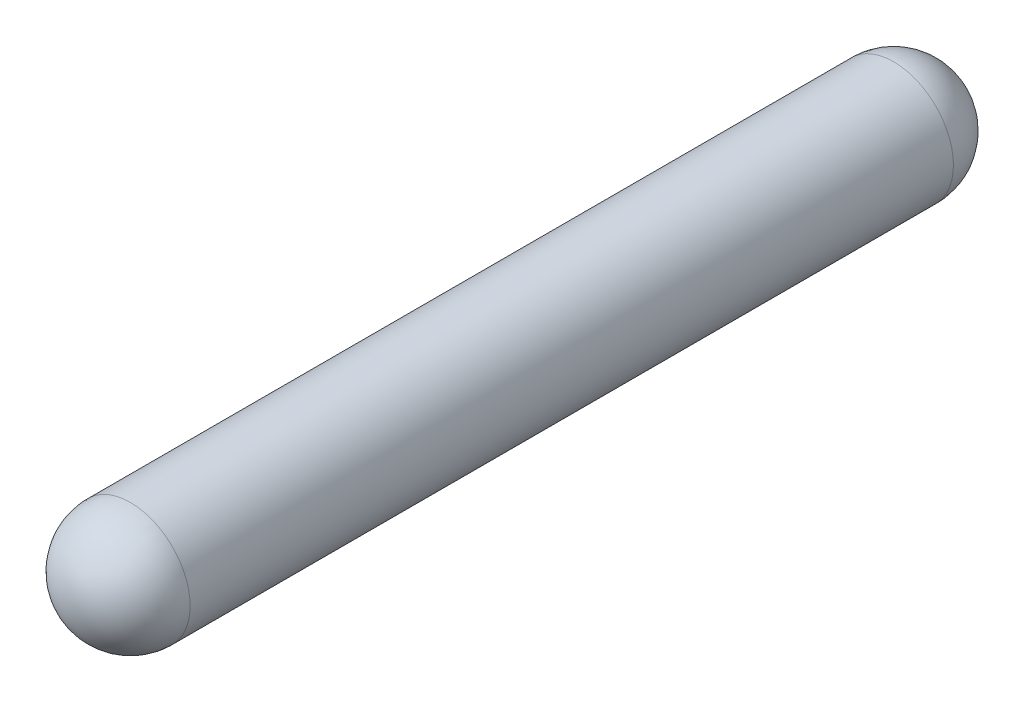
ISO-10303-21;
HEADER;
FILE_DESCRIPTION(('STEP AP214'),'2;1');
FILE_NAME('part.step','',(''),(''),'','','');
FILE_SCHEMA(('AUTOMOTIVE_DESIGN { 1 0 10303 214 1 1 1 1 }'));
ENDSEC;
DATA;
#1=APPLICATION_CONTEXT('core data for automotive mechanical design processes');
#2=APPLICATION_PROTOCOL_DEFINITION('international standard','automotive_design',2000,#1);
#3=PRODUCT_CONTEXT('',#1,'mechanical');
#4=PRODUCT('Part','Part','',(#3));
#5=PRODUCT_RELATED_PRODUCT_CATEGORY('part','',(#4));
#6=PRODUCT_DEFINITION_FORMATION('','',#4);
#7=PRODUCT_DEFINITION_CONTEXT('part definition',#1,'design');
#8=PRODUCT_DEFINITION('design','',#6,#7);
#9=PRODUCT_DEFINITION_SHAPE('','',#8);
#10=(LENGTH_UNIT() NAMED_UNIT(*) SI_UNIT(.MILLI.,.METRE.));
#11=(NAMED_UNIT(*) PLANE_ANGLE_UNIT() SI_UNIT($,.RADIAN.));
#12=(NAMED_UNIT(*) SI_UNIT($,.STERADIAN.) SOLID_ANGLE_UNIT());
#13=UNCERTAINTY_MEASURE_WITH_UNIT(LENGTH_MEASURE(1.E-05),#10,'distance_accuracy_value','');
#14=(GEOMETRIC_REPRESENTATION_CONTEXT(3) GLOBAL_UNCERTAINTY_ASSIGNED_CONTEXT((#13)) GLOBAL_UNIT_ASSIGNED_CONTEXT((#10,
#11,#12)) REPRESENTATION_CONTEXT('',''));
#15=CARTESIAN_POINT('',(0.,0.,0.));
#16=DIRECTION('',(0.,0.,1.));
#17=DIRECTION('',(1.,0.,0.));
#18=AXIS2_PLACEMENT_3D('',#15,#16,#17);
#19=CARTESIAN_POINT('',(5.08,0.,-3.));
#20=DIRECTION('',(1.,0.,0.));
#21=DIRECTION('',(0.,-1.,0.));
#22=AXIS2_PLACEMENT_3D('',#19,#20,#21);
#23=SPHERICAL_SURFACE('',#22,0.712);
#24=CARTESIAN_POINT('',(5.08,0.,-3.));
#25=DIRECTION('',(0.,0.,1.));
#26=DIRECTION('',(1.,0.,0.));
#27=AXIS2_PLACEMENT_3D('',#24,#25,#26);
#28=CIRCLE('',#27,0.712);
#29=CARTESIAN_POINT('',(5.792,0.,-3.));
#30=VERTEX_POINT('',#29);
#31=CARTESIAN_POINT('',(4.368,0.,-3.));
#32=VERTEX_POINT('',#31);
#33=EDGE_CURVE('E41',#30,#32,#28,.T.);
#34=ORIENTED_EDGE('',*,*,#33,.F.);
#35=CARTESIAN_POINT('',(5.08,0.,-3.));
#36=DIRECTION('',(0.,0.,1.));
#37=DIRECTION('',(1.,0.,0.));
#38=AXIS2_PLACEMENT_3D('',#35,#36,#37);
#39=CIRCLE('',#38,0.712);
#40=EDGE_CURVE('E25',#32,#30,#39,.T.);
#41=ORIENTED_EDGE('',*,*,#40,.F.);
#42=EDGE_LOOP('',(#34,#41));
#43=FACE_BOUND('',#42,.T.);
#44=ADVANCED_FACE('F16',(#43),#23,.T.);
#45=CARTESIAN_POINT('',(5.08,0.,6.1));
#46=DIRECTION('',(1.,0.,0.));
#47=DIRECTION('',(0.,1.,0.));
#48=AXIS2_PLACEMENT_3D('',#45,#46,#47);
#49=SPHERICAL_SURFACE('',#48,0.712);
#50=CARTESIAN_POINT('',(5.08,0.,6.1));
#51=DIRECTION('',(0.,0.,1.));
#52=DIRECTION('',(1.,0.,0.));
#53=AXIS2_PLACEMENT_3D('',#50,#51,#52);
#54=CIRCLE('',#53,0.712);
#55=CARTESIAN_POINT('',(5.792,0.,6.1));
#56=VERTEX_POINT('',#55);
#57=CARTESIAN_POINT('',(4.368,0.,6.1));
#58=VERTEX_POINT('',#57);
#59=EDGE_CURVE('E11',#56,#58,#54,.F.);
#60=ORIENTED_EDGE('',*,*,#59,.F.);
#61=CARTESIAN_POINT('',(5.08,0.,6.1));
#62=DIRECTION('',(0.,0.,1.));
#63=DIRECTION('',(1.,0.,0.));
#64=AXIS2_PLACEMENT_3D('',#61,#62,#63);
#65=CIRCLE('',#64,0.712);
#66=EDGE_CURVE('E33',#58,#56,#65,.F.);
#67=ORIENTED_EDGE('',*,*,#66,.F.);
#68=EDGE_LOOP('',(#60,#67));
#69=FACE_BOUND('',#68,.T.);
#70=ADVANCED_FACE('F48',(#69),#49,.T.);
#71=CARTESIAN_POINT('',(5.08,0.,-3.));
#72=DIRECTION('',(0.,0.,1.));
#73=DIRECTION('',(1.,0.,0.));
#74=AXIS2_PLACEMENT_3D('',#71,#72,#73);
#75=CYLINDRICAL_SURFACE('',#74,0.712);
#76=ORIENTED_EDGE('',*,*,#66,.T.);
#77=ORIENTED_EDGE('',*,*,#59,.T.);
#78=EDGE_LOOP('',(#76,#77));
#79=FACE_BOUND('',#78,.T.);
#80=ORIENTED_EDGE('',*,*,#40,.T.);
#81=ORIENTED_EDGE('',*,*,#33,.T.);
#82=EDGE_LOOP('',(#80,#81));
#83=FACE_BOUND('',#82,.T.);
#84=ADVANCED_FACE('F44',(#79,#83),#75,.T.);
#85=CLOSED_SHELL('',(#44,#70,#84));
#86=MANIFOLD_SOLID_BREP('B1',#85);
#87=ADVANCED_BREP_SHAPE_REPRESENTATION('',(#18,#86),#14);
#88=SHAPE_DEFINITION_REPRESENTATION(#9,#87);
ENDSEC;
END-ISO-10303-21;
